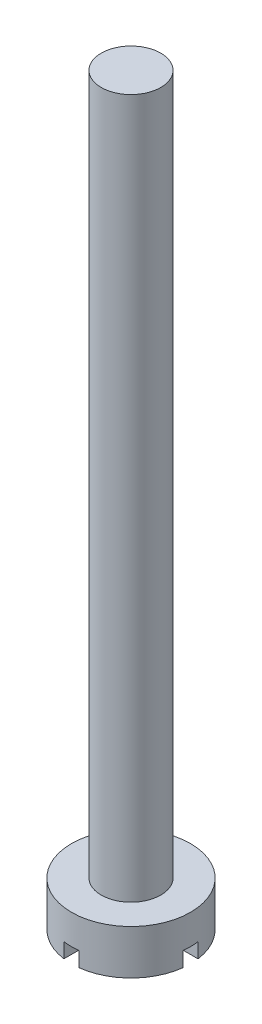
ISO-10303-21;
HEADER;
FILE_DESCRIPTION(('STEP AP214'),'2;1');
FILE_NAME('part.step','',(''),(''),'','','');
FILE_SCHEMA(('AUTOMOTIVE_DESIGN { 1 0 10303 214 1 1 1 1 }'));
ENDSEC;
DATA;
#1=APPLICATION_CONTEXT('core data for automotive mechanical design processes');
#2=APPLICATION_PROTOCOL_DEFINITION('international standard','automotive_design',2000,#1);
#3=PRODUCT_CONTEXT('',#1,'mechanical');
#4=PRODUCT('Part','Part','',(#3));
#5=PRODUCT_RELATED_PRODUCT_CATEGORY('part','',(#4));
#6=PRODUCT_DEFINITION_FORMATION('','',#4);
#7=PRODUCT_DEFINITION_CONTEXT('part definition',#1,'design');
#8=PRODUCT_DEFINITION('design','',#6,#7);
#9=PRODUCT_DEFINITION_SHAPE('','',#8);
#10=(LENGTH_UNIT() NAMED_UNIT(*) SI_UNIT(.MILLI.,.METRE.));
#11=(NAMED_UNIT(*) PLANE_ANGLE_UNIT() SI_UNIT($,.RADIAN.));
#12=(NAMED_UNIT(*) SI_UNIT($,.STERADIAN.) SOLID_ANGLE_UNIT());
#13=UNCERTAINTY_MEASURE_WITH_UNIT(LENGTH_MEASURE(1.E-05),#10,'distance_accuracy_value','');
#14=(GEOMETRIC_REPRESENTATION_CONTEXT(3) GLOBAL_UNCERTAINTY_ASSIGNED_CONTEXT((#13)) GLOBAL_UNIT_ASSIGNED_CONTEXT((#10,
#11,#12)) REPRESENTATION_CONTEXT('',''));
#15=CARTESIAN_POINT('',(0.,0.,0.));
#16=DIRECTION('',(0.,0.,1.));
#17=DIRECTION('',(1.,0.,0.));
#18=AXIS2_PLACEMENT_3D('',#15,#16,#17);
#19=CARTESIAN_POINT('',(0.,0.,0.));
#20=DIRECTION('',(0.,1.,0.));
#21=DIRECTION('',(0.,0.,1.));
#22=AXIS2_PLACEMENT_3D('',#19,#20,#21);
#23=PLANE('',#22);
#24=DIRECTION('',(0.,0.,1.));
#25=VECTOR('',#24,1.);
#26=CARTESIAN_POINT('',(-0.548123781601143,0.,0.));
#27=LINE('',#26,#25);
#28=CARTESIAN_POINT('',(-0.548123781601143,0.,-3.96226706823799));
#29=VERTEX_POINT('',#28);
#30=CARTESIAN_POINT('',(-0.548123781601143,0.,-0.542853360624412));
#31=VERTEX_POINT('',#30);
#32=EDGE_CURVE('E166',#29,#31,#27,.T.);
#33=ORIENTED_EDGE('',*,*,#32,.T.);
#34=DIRECTION('',(-1.,0.,0.));
#35=VECTOR('',#34,1.);
#36=CARTESIAN_POINT('',(0.,0.,-0.542853360624412));
#37=LINE('',#36,#35);
#38=CARTESIAN_POINT('',(-3.96299258501183,0.,-0.542853360624412));
#39=VERTEX_POINT('',#38);
#40=EDGE_CURVE('E201',#31,#39,#37,.T.);
#41=ORIENTED_EDGE('',*,*,#40,.T.);
#42=CARTESIAN_POINT('',(0.,0.,0.));
#43=DIRECTION('',(0.,1.,0.));
#44=DIRECTION('',(0.,0.,1.));
#45=AXIS2_PLACEMENT_3D('',#42,#43,#44);
#46=CIRCLE('',#45,4.);
#47=EDGE_CURVE('E259',#29,#39,#46,.T.);
#48=ORIENTED_EDGE('',*,*,#47,.F.);
#49=EDGE_LOOP('',(#33,#41,#48));
#50=FACE_BOUND('',#49,.T.);
#51=ADVANCED_FACE('F69',(#50),#23,.F.);
#52=DIRECTION('',(-1.,0.,0.));
#53=VECTOR('',#52,1.);
#54=CARTESIAN_POINT('',(0.,0.,-0.542853360624412));
#55=LINE('',#54,#53);
#56=CARTESIAN_POINT('',(3.96299258501183,0.,-0.542853360624412));
#57=VERTEX_POINT('',#56);
#58=CARTESIAN_POINT('',(0.463797045970191,0.,-0.542853360624412));
#59=VERTEX_POINT('',#58);
#60=EDGE_CURVE('E194',#57,#59,#55,.T.);
#61=ORIENTED_EDGE('',*,*,#60,.T.);
#62=DIRECTION('',(0.,0.,1.));
#63=VECTOR('',#62,1.);
#64=CARTESIAN_POINT('',(0.463797045970191,0.,0.));
#65=LINE('',#64,#63);
#66=CARTESIAN_POINT('',(0.463797045970191,0.,-3.97302055118638));
#67=VERTEX_POINT('',#66);
#68=EDGE_CURVE('E171',#67,#59,#65,.T.);
#69=ORIENTED_EDGE('',*,*,#68,.F.);
#70=EDGE_CURVE('E243',#57,#67,#46,.T.);
#71=ORIENTED_EDGE('',*,*,#70,.F.);
#72=EDGE_LOOP('',(#61,#69,#71));
#73=FACE_BOUND('',#72,.T.);
#74=ADVANCED_FACE('F282',(#73),#23,.F.);
#75=CARTESIAN_POINT('',(-3.97240175604783,0.,0.46906746694701));
#76=VERTEX_POINT('',#75);
#77=CARTESIAN_POINT('',(-0.548123781601143,0.,3.96226706823799));
#78=VERTEX_POINT('',#77);
#79=EDGE_CURVE('E235',#76,#78,#46,.T.);
#80=ORIENTED_EDGE('',*,*,#79,.F.);
#81=DIRECTION('',(-1.,0.,0.));
#82=VECTOR('',#81,1.);
#83=CARTESIAN_POINT('',(0.,0.,0.46906746694701));
#84=LINE('',#83,#82);
#85=CARTESIAN_POINT('',(-0.548123781601143,0.,0.46906746694701));
#86=VERTEX_POINT('',#85);
#87=EDGE_CURVE('E197',#86,#76,#84,.T.);
#88=ORIENTED_EDGE('',*,*,#87,.F.);
#89=DIRECTION('',(0.,0.,1.));
#90=VECTOR('',#89,1.);
#91=CARTESIAN_POINT('',(-0.548123781601143,0.,-4.18998467666297));
#92=LINE('',#91,#90);
#93=EDGE_CURVE('E222',#86,#78,#92,.T.);
#94=ORIENTED_EDGE('',*,*,#93,.T.);
#95=EDGE_LOOP('',(#80,#88,#94));
#96=FACE_BOUND('',#95,.T.);
#97=ADVANCED_FACE('F269',(#96),#23,.F.);
#98=CARTESIAN_POINT('',(0.,3.,0.));
#99=DIRECTION('',(0.,-1.,0.));
#100=DIRECTION('',(0.,0.,-1.));
#101=AXIS2_PLACEMENT_3D('',#98,#99,#100);
#102=CYLINDRICAL_SURFACE('',#101,4.);
#103=CARTESIAN_POINT('',(0.,3.,0.));
#104=DIRECTION('',(0.,1.,0.));
#105=DIRECTION('',(0.,0.,1.));
#106=AXIS2_PLACEMENT_3D('',#103,#104,#105);
#107=CIRCLE('',#106,4.);
#108=CARTESIAN_POINT('',(0.,3.,4.));
#109=VERTEX_POINT('',#108);
#110=EDGE_CURVE('E236',#109,#109,#107,.T.);
#111=ORIENTED_EDGE('',*,*,#110,.F.);
#112=EDGE_LOOP('',(#111));
#113=FACE_BOUND('',#112,.T.);
#114=CARTESIAN_POINT('',(0.463797045970191,0.,3.97302055118638));
#115=VERTEX_POINT('',#114);
#116=CARTESIAN_POINT('',(3.97240175604783,0.,0.46906746694701));
#117=VERTEX_POINT('',#116);
#118=EDGE_CURVE('E240',#115,#117,#46,.T.);
#119=ORIENTED_EDGE('',*,*,#118,.T.);
#120=DIRECTION('',(0.,-1.,0.));
#121=VECTOR('',#120,1.);
#122=CARTESIAN_POINT('',(3.97240175604783,1.,0.46906746694701));
#123=LINE('',#122,#121);
#124=CARTESIAN_POINT('',(3.97240175604783,1.,0.46906746694701));
#125=VERTEX_POINT('',#124);
#126=EDGE_CURVE('E214',#125,#117,#123,.T.);
#127=ORIENTED_EDGE('',*,*,#126,.F.);
#128=CARTESIAN_POINT('',(0.,1.,0.));
#129=DIRECTION('',(0.,-1.,0.));
#130=DIRECTION('',(0.,0.,-1.));
#131=AXIS2_PLACEMENT_3D('',#128,#129,#130);
#132=CIRCLE('',#131,4.);
#133=CARTESIAN_POINT('',(3.96299258501183,1.,-0.542853360624412));
#134=VERTEX_POINT('',#133);
#135=EDGE_CURVE('E179',#134,#125,#132,.T.);
#136=ORIENTED_EDGE('',*,*,#135,.F.);
#137=DIRECTION('',(0.,-1.,0.));
#138=VECTOR('',#137,1.);
#139=CARTESIAN_POINT('',(3.96299258501183,1.,-0.542853360624412));
#140=LINE('',#139,#138);
#141=EDGE_CURVE('E174',#134,#57,#140,.T.);
#142=ORIENTED_EDGE('',*,*,#141,.T.);
#143=ORIENTED_EDGE('',*,*,#70,.T.);
#144=DIRECTION('',(0.,-1.,0.));
#145=VECTOR('',#144,1.);
#146=CARTESIAN_POINT('',(0.463797045970191,3.,-3.97302055118638));
#147=LINE('',#146,#145);
#148=CARTESIAN_POINT('',(0.463797045970191,1.,-3.97302055118638));
#149=VERTEX_POINT('',#148);
#150=EDGE_CURVE('E12',#67,#149,#147,.F.);
#151=ORIENTED_EDGE('',*,*,#150,.T.);
#152=CARTESIAN_POINT('',(0.,1.,0.));
#153=DIRECTION('',(0.,-1.,0.));
#154=DIRECTION('',(0.,0.,-1.));
#155=AXIS2_PLACEMENT_3D('',#152,#153,#154);
#156=CIRCLE('',#155,4.);
#157=CARTESIAN_POINT('',(-0.548123781601143,1.,-3.96226706823799));
#158=VERTEX_POINT('',#157);
#159=EDGE_CURVE('E165',#158,#149,#156,.T.);
#160=ORIENTED_EDGE('',*,*,#159,.F.);
#161=DIRECTION('',(0.,-1.,0.));
#162=VECTOR('',#161,1.);
#163=CARTESIAN_POINT('',(-0.548123781601143,3.,-3.96226706823799));
#164=LINE('',#163,#162);
#165=EDGE_CURVE('E77',#29,#158,#164,.F.);
#166=ORIENTED_EDGE('',*,*,#165,.F.);
#167=ORIENTED_EDGE('',*,*,#47,.T.);
#168=DIRECTION('',(0.,-1.,0.));
#169=VECTOR('',#168,1.);
#170=CARTESIAN_POINT('',(-3.96299258501183,1.,-0.542853360624412));
#171=LINE('',#170,#169);
#172=CARTESIAN_POINT('',(-3.96299258501183,1.,-0.542853360624412));
#173=VERTEX_POINT('',#172);
#174=EDGE_CURVE('E209',#173,#39,#171,.T.);
#175=ORIENTED_EDGE('',*,*,#174,.F.);
#176=CARTESIAN_POINT('',(0.,1.,0.));
#177=DIRECTION('',(0.,-1.,0.));
#178=DIRECTION('',(0.,0.,-1.));
#179=AXIS2_PLACEMENT_3D('',#176,#177,#178);
#180=CIRCLE('',#179,4.);
#181=CARTESIAN_POINT('',(-3.97240175604783,1.,0.46906746694701));
#182=VERTEX_POINT('',#181);
#183=EDGE_CURVE('E187',#182,#173,#180,.T.);
#184=ORIENTED_EDGE('',*,*,#183,.F.);
#185=DIRECTION('',(0.,-1.,0.));
#186=VECTOR('',#185,1.);
#187=CARTESIAN_POINT('',(-3.97240175604783,1.,0.46906746694701));
#188=LINE('',#187,#186);
#189=EDGE_CURVE('E211',#182,#76,#188,.T.);
#190=ORIENTED_EDGE('',*,*,#189,.T.);
#191=ORIENTED_EDGE('',*,*,#79,.T.);
#192=DIRECTION('',(0.,-1.,0.));
#193=VECTOR('',#192,1.);
#194=CARTESIAN_POINT('',(-0.548123781601143,3.,3.96226706823799));
#195=LINE('',#194,#193);
#196=CARTESIAN_POINT('',(-0.548123781601143,1.,3.96226706823799));
#197=VERTEX_POINT('',#196);
#198=EDGE_CURVE('E247',#197,#78,#195,.T.);
#199=ORIENTED_EDGE('',*,*,#198,.F.);
#200=CARTESIAN_POINT('',(0.463797045970191,1.,3.97302055118638));
#201=VERTEX_POINT('',#200);
#202=EDGE_CURVE('E245',#201,#197,#156,.T.);
#203=ORIENTED_EDGE('',*,*,#202,.F.);
#204=DIRECTION('',(0.,-1.,0.));
#205=VECTOR('',#204,1.);
#206=CARTESIAN_POINT('',(0.463797045970191,3.,3.97302055118638));
#207=LINE('',#206,#205);
#208=EDGE_CURVE('E239',#201,#115,#207,.T.);
#209=ORIENTED_EDGE('',*,*,#208,.T.);
#210=EDGE_LOOP('',(#119,#127,#136,#142,#143,#151,#160,#166,#167,#175,#184,#190,#191,#199,#203,#209));
#211=FACE_BOUND('',#210,.T.);
#212=ADVANCED_FACE('F71',(#113,#211),#102,.T.);
#213=CARTESIAN_POINT('',(0.,3.,0.));
#214=DIRECTION('',(0.,1.,0.));
#215=DIRECTION('',(0.,0.,1.));
#216=AXIS2_PLACEMENT_3D('',#213,#214,#215);
#217=PLANE('',#216);
#218=ORIENTED_EDGE('',*,*,#110,.T.);
#219=EDGE_LOOP('',(#218));
#220=FACE_BOUND('',#219,.T.);
#221=CARTESIAN_POINT('',(0.,3.,0.));
#222=DIRECTION('',(0.,1.,0.));
#223=DIRECTION('',(0.,0.,1.));
#224=AXIS2_PLACEMENT_3D('',#221,#222,#223);
#225=CIRCLE('',#224,2.);
#226=CARTESIAN_POINT('',(0.,3.,2.));
#227=VERTEX_POINT('',#226);
#228=EDGE_CURVE('E232',#227,#227,#225,.T.);
#229=ORIENTED_EDGE('',*,*,#228,.F.);
#230=EDGE_LOOP('',(#229));
#231=FACE_BOUND('',#230,.T.);
#232=ADVANCED_FACE('F290',(#220,#231),#217,.T.);
#233=DIRECTION('',(0.,0.,1.));
#234=VECTOR('',#233,1.);
#235=CARTESIAN_POINT('',(0.463797045970191,0.,-4.18998467666297));
#236=LINE('',#235,#234);
#237=CARTESIAN_POINT('',(0.463797045970191,0.,0.46906746694701));
#238=VERTEX_POINT('',#237);
#239=EDGE_CURVE('E84',#238,#115,#236,.T.);
#240=ORIENTED_EDGE('',*,*,#239,.F.);
#241=EDGE_CURVE('E198',#117,#238,#84,.T.);
#242=ORIENTED_EDGE('',*,*,#241,.F.);
#243=ORIENTED_EDGE('',*,*,#118,.F.);
#244=EDGE_LOOP('',(#240,#242,#243));
#245=FACE_BOUND('',#244,.T.);
#246=ADVANCED_FACE('F283',(#245),#23,.F.);
#247=CARTESIAN_POINT('',(0.,50.,0.));
#248=DIRECTION('',(0.,-1.,0.));
#249=DIRECTION('',(0.,0.,-1.));
#250=AXIS2_PLACEMENT_3D('',#247,#248,#249);
#251=CYLINDRICAL_SURFACE('',#250,2.);
#252=ORIENTED_EDGE('',*,*,#228,.T.);
#253=EDGE_LOOP('',(#252));
#254=FACE_BOUND('',#253,.T.);
#255=CARTESIAN_POINT('',(0.,50.,0.));
#256=DIRECTION('',(0.,1.,0.));
#257=DIRECTION('',(0.,0.,1.));
#258=AXIS2_PLACEMENT_3D('',#255,#256,#257);
#259=CIRCLE('',#258,2.);
#260=CARTESIAN_POINT('',(0.,50.,2.));
#261=VERTEX_POINT('',#260);
#262=EDGE_CURVE('E229',#261,#261,#259,.T.);
#263=ORIENTED_EDGE('',*,*,#262,.F.);
#264=EDGE_LOOP('',(#263));
#265=FACE_BOUND('',#264,.T.);
#266=ADVANCED_FACE('F289',(#254,#265),#251,.T.);
#267=CARTESIAN_POINT('',(0.,50.,0.));
#268=DIRECTION('',(0.,1.,0.));
#269=DIRECTION('',(0.,0.,1.));
#270=AXIS2_PLACEMENT_3D('',#267,#268,#269);
#271=PLANE('',#270);
#272=ORIENTED_EDGE('',*,*,#262,.T.);
#273=EDGE_LOOP('',(#272));
#274=FACE_BOUND('',#273,.T.);
#275=ADVANCED_FACE('F296',(#274),#271,.T.);
#276=CARTESIAN_POINT('',(0.463797045970191,1.,0.));
#277=DIRECTION('',(1.,0.,0.));
#278=DIRECTION('',(0.,0.,-1.));
#279=AXIS2_PLACEMENT_3D('',#276,#277,#278);
#280=PLANE('',#279);
#281=ORIENTED_EDGE('',*,*,#68,.T.);
#282=DIRECTION('',(0.,-1.,0.));
#283=VECTOR('',#282,1.);
#284=CARTESIAN_POINT('',(0.463797045970191,1.,-0.542853360624412));
#285=LINE('',#284,#283);
#286=CARTESIAN_POINT('',(0.463797045970191,1.,-0.542853360624412));
#287=VERTEX_POINT('',#286);
#288=EDGE_CURVE('E169',#287,#59,#285,.T.);
#289=ORIENTED_EDGE('',*,*,#288,.F.);
#290=DIRECTION('',(0.,0.,1.));
#291=VECTOR('',#290,1.);
#292=CARTESIAN_POINT('',(0.463797045970191,1.,0.));
#293=LINE('',#292,#291);
#294=EDGE_CURVE('E156',#149,#287,#293,.T.);
#295=ORIENTED_EDGE('',*,*,#294,.F.);
#296=ORIENTED_EDGE('',*,*,#150,.F.);
#297=EDGE_LOOP('',(#281,#289,#295,#296));
#298=FACE_BOUND('',#297,.T.);
#299=ADVANCED_FACE('F170',(#298),#280,.F.);
#300=CARTESIAN_POINT('',(-0.548123781601143,1.,0.));
#301=DIRECTION('',(1.,0.,0.));
#302=DIRECTION('',(0.,0.,-1.));
#303=AXIS2_PLACEMENT_3D('',#300,#301,#302);
#304=PLANE('',#303);
#305=ORIENTED_EDGE('',*,*,#165,.T.);
#306=DIRECTION('',(0.,0.,1.));
#307=VECTOR('',#306,1.);
#308=CARTESIAN_POINT('',(-0.548123781601143,1.,0.));
#309=LINE('',#308,#307);
#310=CARTESIAN_POINT('',(-0.548123781601143,1.,-0.542853360624412));
#311=VERTEX_POINT('',#310);
#312=EDGE_CURVE('E175',#158,#311,#309,.T.);
#313=ORIENTED_EDGE('',*,*,#312,.T.);
#314=DIRECTION('',(0.,-1.,0.));
#315=VECTOR('',#314,1.);
#316=CARTESIAN_POINT('',(-0.548123781601143,1.,-0.542853360624412));
#317=LINE('',#316,#315);
#318=EDGE_CURVE('E206',#311,#31,#317,.T.);
#319=ORIENTED_EDGE('',*,*,#318,.T.);
#320=ORIENTED_EDGE('',*,*,#32,.F.);
#321=EDGE_LOOP('',(#305,#313,#319,#320));
#322=FACE_BOUND('',#321,.T.);
#323=ADVANCED_FACE('F250',(#322),#304,.T.);
#324=CARTESIAN_POINT('',(0.,1.,0.));
#325=DIRECTION('',(0.,-1.,0.));
#326=DIRECTION('',(0.,0.,-1.));
#327=AXIS2_PLACEMENT_3D('',#324,#325,#326);
#328=PLANE('',#327);
#329=ORIENTED_EDGE('',*,*,#202,.T.);
#330=DIRECTION('',(0.,0.,1.));
#331=VECTOR('',#330,1.);
#332=CARTESIAN_POINT('',(-0.548123781601143,1.,-4.18998467666297));
#333=LINE('',#332,#331);
#334=CARTESIAN_POINT('',(-0.548123781601143,1.,0.46906746694701));
#335=VERTEX_POINT('',#334);
#336=EDGE_CURVE('E217',#335,#197,#333,.T.);
#337=ORIENTED_EDGE('',*,*,#336,.F.);
#338=DIRECTION('',(-1.,0.,0.));
#339=VECTOR('',#338,1.);
#340=CARTESIAN_POINT('',(0.,1.,0.46906746694701));
#341=LINE('',#340,#339);
#342=EDGE_CURVE('E181',#335,#182,#341,.T.);
#343=ORIENTED_EDGE('',*,*,#342,.T.);
#344=ORIENTED_EDGE('',*,*,#183,.T.);
#345=DIRECTION('',(-1.,0.,0.));
#346=VECTOR('',#345,1.);
#347=CARTESIAN_POINT('',(0.,1.,-0.542853360624412));
#348=LINE('',#347,#346);
#349=EDGE_CURVE('E190',#311,#173,#348,.T.);
#350=ORIENTED_EDGE('',*,*,#349,.F.);
#351=ORIENTED_EDGE('',*,*,#312,.F.);
#352=ORIENTED_EDGE('',*,*,#159,.T.);
#353=ORIENTED_EDGE('',*,*,#294,.T.);
#354=DIRECTION('',(-1.,0.,0.));
#355=VECTOR('',#354,1.);
#356=CARTESIAN_POINT('',(0.,1.,-0.542853360624412));
#357=LINE('',#356,#355);
#358=EDGE_CURVE('E161',#134,#287,#357,.T.);
#359=ORIENTED_EDGE('',*,*,#358,.F.);
#360=ORIENTED_EDGE('',*,*,#135,.T.);
#361=CARTESIAN_POINT('',(0.463797045970191,1.,0.46906746694701));
#362=VERTEX_POINT('',#361);
#363=EDGE_CURVE('E184',#125,#362,#341,.T.);
#364=ORIENTED_EDGE('',*,*,#363,.T.);
#365=DIRECTION('',(0.,0.,1.));
#366=VECTOR('',#365,1.);
#367=CARTESIAN_POINT('',(0.463797045970191,1.,-4.18998467666297));
#368=LINE('',#367,#366);
#369=EDGE_CURVE('E195',#362,#201,#368,.T.);
#370=ORIENTED_EDGE('',*,*,#369,.T.);
#371=EDGE_LOOP('',(#329,#337,#343,#344,#350,#351,#352,#353,#359,#360,#364,#370));
#372=FACE_BOUND('',#371,.T.);
#373=ADVANCED_FACE('F158',(#372),#328,.T.);
#374=CARTESIAN_POINT('',(-0.548123781601143,1.,-4.18998467666297));
#375=DIRECTION('',(1.,0.,0.));
#376=DIRECTION('',(0.,0.,-1.));
#377=AXIS2_PLACEMENT_3D('',#374,#375,#376);
#378=PLANE('',#377);
#379=ORIENTED_EDGE('',*,*,#198,.T.);
#380=ORIENTED_EDGE('',*,*,#93,.F.);
#381=DIRECTION('',(0.,1.,0.));
#382=VECTOR('',#381,1.);
#383=CARTESIAN_POINT('',(-0.548123781601143,1.,0.46906746694701));
#384=LINE('',#383,#382);
#385=EDGE_CURVE('E227',#86,#335,#384,.T.);
#386=ORIENTED_EDGE('',*,*,#385,.T.);
#387=ORIENTED_EDGE('',*,*,#336,.T.);
#388=EDGE_LOOP('',(#379,#380,#386,#387));
#389=FACE_BOUND('',#388,.T.);
#390=ADVANCED_FACE('F272',(#389),#378,.T.);
#391=CARTESIAN_POINT('',(0.463797045970191,1.,-4.18998467666297));
#392=DIRECTION('',(1.,0.,0.));
#393=DIRECTION('',(0.,0.,-1.));
#394=AXIS2_PLACEMENT_3D('',#391,#392,#393);
#395=PLANE('',#394);
#396=ORIENTED_EDGE('',*,*,#369,.F.);
#397=DIRECTION('',(0.,1.,0.));
#398=VECTOR('',#397,1.);
#399=CARTESIAN_POINT('',(0.463797045970191,1.,0.46906746694701));
#400=LINE('',#399,#398);
#401=EDGE_CURVE('E208',#238,#362,#400,.T.);
#402=ORIENTED_EDGE('',*,*,#401,.F.);
#403=ORIENTED_EDGE('',*,*,#239,.T.);
#404=ORIENTED_EDGE('',*,*,#208,.F.);
#405=EDGE_LOOP('',(#396,#402,#403,#404));
#406=FACE_BOUND('',#405,.T.);
#407=ADVANCED_FACE('F322',(#406),#395,.F.);
#408=CARTESIAN_POINT('',(0.,1.,0.46906746694701));
#409=DIRECTION('',(0.,0.,1.));
#410=DIRECTION('',(1.,0.,0.));
#411=AXIS2_PLACEMENT_3D('',#408,#409,#410);
#412=PLANE('',#411);
#413=ORIENTED_EDGE('',*,*,#401,.T.);
#414=ORIENTED_EDGE('',*,*,#363,.F.);
#415=ORIENTED_EDGE('',*,*,#126,.T.);
#416=ORIENTED_EDGE('',*,*,#241,.T.);
#417=EDGE_LOOP('',(#413,#414,#415,#416));
#418=FACE_BOUND('',#417,.T.);
#419=ADVANCED_FACE('F324',(#418),#412,.F.);
#420=CARTESIAN_POINT('',(0.,1.,-0.542853360624412));
#421=DIRECTION('',(0.,0.,1.));
#422=DIRECTION('',(1.,0.,0.));
#423=AXIS2_PLACEMENT_3D('',#420,#421,#422);
#424=PLANE('',#423);
#425=ORIENTED_EDGE('',*,*,#60,.F.);
#426=ORIENTED_EDGE('',*,*,#141,.F.);
#427=ORIENTED_EDGE('',*,*,#358,.T.);
#428=ORIENTED_EDGE('',*,*,#288,.T.);
#429=EDGE_LOOP('',(#425,#426,#427,#428));
#430=FACE_BOUND('',#429,.T.);
#431=ADVANCED_FACE('F177',(#430),#424,.T.);
#432=ORIENTED_EDGE('',*,*,#87,.T.);
#433=ORIENTED_EDGE('',*,*,#189,.F.);
#434=ORIENTED_EDGE('',*,*,#342,.F.);
#435=ORIENTED_EDGE('',*,*,#385,.F.);
#436=EDGE_LOOP('',(#432,#433,#434,#435));
#437=FACE_BOUND('',#436,.T.);
#438=ADVANCED_FACE('F276',(#437),#412,.F.);
#439=CARTESIAN_POINT('',(0.,1.,-0.542853360624412));
#440=DIRECTION('',(0.,0.,1.));
#441=DIRECTION('',(1.,0.,0.));
#442=AXIS2_PLACEMENT_3D('',#439,#440,#441);
#443=PLANE('',#442);
#444=ORIENTED_EDGE('',*,*,#40,.F.);
#445=ORIENTED_EDGE('',*,*,#318,.F.);
#446=ORIENTED_EDGE('',*,*,#349,.T.);
#447=ORIENTED_EDGE('',*,*,#174,.T.);
#448=EDGE_LOOP('',(#444,#445,#446,#447));
#449=FACE_BOUND('',#448,.T.);
#450=ADVANCED_FACE('F279',(#449),#443,.T.);
#451=CLOSED_SHELL('',(#51,#74,#97,#212,#232,#246,#266,#275,#299,#323,#373,#390,#407,#419,#431,
#438,#450));
#452=MANIFOLD_SOLID_BREP('B2',#451);
#453=ADVANCED_BREP_SHAPE_REPRESENTATION('',(#18,#452),#14);
#454=SHAPE_DEFINITION_REPRESENTATION(#9,#453);
ENDSEC;
END-ISO-10303-21;
